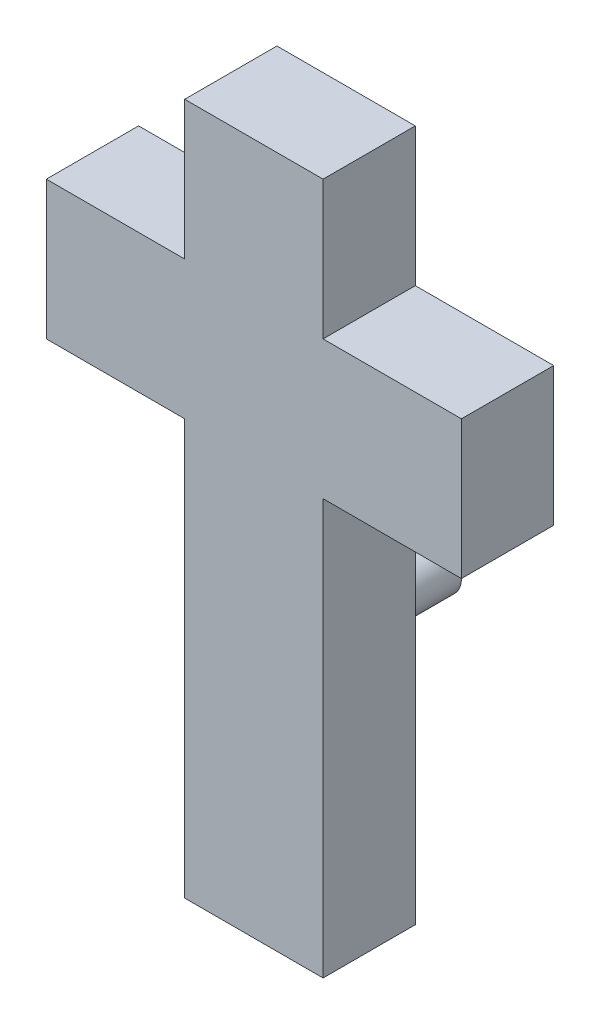
ISO-10303-21;
HEADER;
FILE_DESCRIPTION(('STEP AP214'),'2;1');
FILE_NAME('part.step','',(''),(''),'','','');
FILE_SCHEMA(('AUTOMOTIVE_DESIGN { 1 0 10303 214 1 1 1 1 }'));
ENDSEC;
DATA;
#1=APPLICATION_CONTEXT('core data for automotive mechanical design processes');
#2=APPLICATION_PROTOCOL_DEFINITION('international standard','automotive_design',2000,#1);
#3=PRODUCT_CONTEXT('',#1,'mechanical');
#4=PRODUCT('Part','Part','',(#3));
#5=PRODUCT_RELATED_PRODUCT_CATEGORY('part','',(#4));
#6=PRODUCT_DEFINITION_FORMATION('','',#4);
#7=PRODUCT_DEFINITION_CONTEXT('part definition',#1,'design');
#8=PRODUCT_DEFINITION('design','',#6,#7);
#9=PRODUCT_DEFINITION_SHAPE('','',#8);
#10=(LENGTH_UNIT() NAMED_UNIT(*) SI_UNIT(.MILLI.,.METRE.));
#11=(NAMED_UNIT(*) PLANE_ANGLE_UNIT() SI_UNIT($,.RADIAN.));
#12=(NAMED_UNIT(*) SI_UNIT($,.STERADIAN.) SOLID_ANGLE_UNIT());
#13=UNCERTAINTY_MEASURE_WITH_UNIT(LENGTH_MEASURE(1.E-05),#10,'distance_accuracy_value','');
#14=(GEOMETRIC_REPRESENTATION_CONTEXT(3) GLOBAL_UNCERTAINTY_ASSIGNED_CONTEXT((#13)) GLOBAL_UNIT_ASSIGNED_CONTEXT((#10,
#11,#12)) REPRESENTATION_CONTEXT('',''));
#15=CARTESIAN_POINT('',(0.,0.,0.));
#16=DIRECTION('',(0.,0.,1.));
#17=DIRECTION('',(1.,0.,0.));
#18=AXIS2_PLACEMENT_3D('',#15,#16,#17);
#19=CARTESIAN_POINT('',(-7.62,22.86,5.08));
#20=DIRECTION('',(-1.,0.,0.));
#21=DIRECTION('',(0.,0.,1.));
#22=AXIS2_PLACEMENT_3D('',#19,#20,#21);
#23=PLANE('',#22);
#24=DIRECTION('',(0.,1.,0.));
#25=VECTOR('',#24,1.);
#26=CARTESIAN_POINT('',(-7.62,22.86,0.));
#27=LINE('',#26,#25);
#28=CARTESIAN_POINT('',(-7.62,22.86,0.));
#29=VERTEX_POINT('',#28);
#30=CARTESIAN_POINT('',(-7.62,30.48,0.));
#31=VERTEX_POINT('',#30);
#32=EDGE_CURVE('E156',#29,#31,#27,.T.);
#33=ORIENTED_EDGE('',*,*,#32,.F.);
#34=DIRECTION('',(0.,0.,-1.));
#35=VECTOR('',#34,1.);
#36=CARTESIAN_POINT('',(-7.62,22.86,5.08));
#37=LINE('',#36,#35);
#38=CARTESIAN_POINT('',(-7.62,22.86,5.08));
#39=VERTEX_POINT('',#38);
#40=EDGE_CURVE('E11',#39,#29,#37,.T.);
#41=ORIENTED_EDGE('',*,*,#40,.F.);
#42=DIRECTION('',(0.,1.,0.));
#43=VECTOR('',#42,1.);
#44=CARTESIAN_POINT('',(-7.62,22.86,5.08));
#45=LINE('',#44,#43);
#46=CARTESIAN_POINT('',(-7.62,30.48,5.08));
#47=VERTEX_POINT('',#46);
#48=EDGE_CURVE('E189',#39,#47,#45,.T.);
#49=ORIENTED_EDGE('',*,*,#48,.T.);
#50=DIRECTION('',(0.,0.,-1.));
#51=VECTOR('',#50,1.);
#52=CARTESIAN_POINT('',(-7.62,30.48,5.08));
#53=LINE('',#52,#51);
#54=EDGE_CURVE('E38',#47,#31,#53,.T.);
#55=ORIENTED_EDGE('',*,*,#54,.T.);
#56=EDGE_LOOP('',(#33,#41,#49,#55));
#57=FACE_BOUND('',#56,.T.);
#58=ADVANCED_FACE('F35',(#57),#23,.T.);
#59=CARTESIAN_POINT('',(0.,22.86,5.08));
#60=DIRECTION('',(0.,-1.,0.));
#61=DIRECTION('',(1.,0.,0.));
#62=AXIS2_PLACEMENT_3D('',#59,#60,#61);
#63=PLANE('',#62);
#64=DIRECTION('',(-1.,0.,0.));
#65=VECTOR('',#64,1.);
#66=CARTESIAN_POINT('',(0.,22.86,0.));
#67=LINE('',#66,#65);
#68=CARTESIAN_POINT('',(0.,22.86,0.));
#69=VERTEX_POINT('',#68);
#70=EDGE_CURVE('E187',#69,#29,#67,.T.);
#71=ORIENTED_EDGE('',*,*,#70,.F.);
#72=DIRECTION('',(0.,0.,-1.));
#73=VECTOR('',#72,1.);
#74=CARTESIAN_POINT('',(0.,22.86,5.08));
#75=LINE('',#74,#73);
#76=CARTESIAN_POINT('',(0.,22.86,5.08));
#77=VERTEX_POINT('',#76);
#78=EDGE_CURVE('E44',#77,#69,#75,.T.);
#79=ORIENTED_EDGE('',*,*,#78,.F.);
#80=DIRECTION('',(-1.,0.,0.));
#81=VECTOR('',#80,1.);
#82=CARTESIAN_POINT('',(0.,22.86,5.08));
#83=LINE('',#82,#81);
#84=EDGE_CURVE('E146',#77,#39,#83,.T.);
#85=ORIENTED_EDGE('',*,*,#84,.T.);
#86=ORIENTED_EDGE('',*,*,#40,.T.);
#87=EDGE_LOOP('',(#71,#79,#85,#86));
#88=FACE_BOUND('',#87,.T.);
#89=ADVANCED_FACE('F209',(#88),#63,.T.);
#90=CARTESIAN_POINT('',(0.,0.,5.08));
#91=DIRECTION('',(-1.,0.,0.));
#92=DIRECTION('',(0.,0.,1.));
#93=AXIS2_PLACEMENT_3D('',#90,#91,#92);
#94=PLANE('',#93);
#95=DIRECTION('',(0.,1.,0.));
#96=VECTOR('',#95,1.);
#97=CARTESIAN_POINT('',(0.,0.,0.));
#98=LINE('',#97,#96);
#99=CARTESIAN_POINT('',(0.,0.,0.));
#100=VERTEX_POINT('',#99);
#101=EDGE_CURVE('E133',#100,#69,#98,.T.);
#102=ORIENTED_EDGE('',*,*,#101,.F.);
#103=DIRECTION('',(0.,0.,-1.));
#104=VECTOR('',#103,1.);
#105=CARTESIAN_POINT('',(0.,0.,5.08));
#106=LINE('',#105,#104);
#107=CARTESIAN_POINT('',(0.,0.,5.08));
#108=VERTEX_POINT('',#107);
#109=EDGE_CURVE('E128',#108,#100,#106,.T.);
#110=ORIENTED_EDGE('',*,*,#109,.F.);
#111=DIRECTION('',(0.,1.,0.));
#112=VECTOR('',#111,1.);
#113=CARTESIAN_POINT('',(0.,0.,5.08));
#114=LINE('',#113,#112);
#115=EDGE_CURVE('E131',#108,#77,#114,.T.);
#116=ORIENTED_EDGE('',*,*,#115,.T.);
#117=ORIENTED_EDGE('',*,*,#78,.T.);
#118=EDGE_LOOP('',(#102,#110,#116,#117));
#119=FACE_BOUND('',#118,.T.);
#120=ADVANCED_FACE('F130',(#119),#94,.T.);
#121=CARTESIAN_POINT('',(7.62,0.,5.08));
#122=DIRECTION('',(0.,-1.,0.));
#123=DIRECTION('',(1.,0.,0.));
#124=AXIS2_PLACEMENT_3D('',#121,#122,#123);
#125=PLANE('',#124);
#126=DIRECTION('',(-1.,0.,0.));
#127=VECTOR('',#126,1.);
#128=CARTESIAN_POINT('',(7.62,0.,0.));
#129=LINE('',#128,#127);
#130=CARTESIAN_POINT('',(7.62,0.,0.));
#131=VERTEX_POINT('',#130);
#132=EDGE_CURVE('E184',#131,#100,#129,.T.);
#133=ORIENTED_EDGE('',*,*,#132,.F.);
#134=DIRECTION('',(0.,0.,-1.));
#135=VECTOR('',#134,1.);
#136=CARTESIAN_POINT('',(7.62,0.,5.08));
#137=LINE('',#136,#135);
#138=CARTESIAN_POINT('',(7.62,0.,5.08));
#139=VERTEX_POINT('',#138);
#140=EDGE_CURVE('E138',#139,#131,#137,.T.);
#141=ORIENTED_EDGE('',*,*,#140,.F.);
#142=DIRECTION('',(-1.,0.,0.));
#143=VECTOR('',#142,1.);
#144=CARTESIAN_POINT('',(7.62,0.,5.08));
#145=LINE('',#144,#143);
#146=EDGE_CURVE('E144',#139,#108,#145,.T.);
#147=ORIENTED_EDGE('',*,*,#146,.T.);
#148=ORIENTED_EDGE('',*,*,#109,.T.);
#149=EDGE_LOOP('',(#133,#141,#147,#148));
#150=FACE_BOUND('',#149,.T.);
#151=ADVANCED_FACE('F148',(#150),#125,.T.);
#152=CARTESIAN_POINT('',(7.62,22.86,5.08));
#153=DIRECTION('',(1.,0.,0.));
#154=DIRECTION('',(0.,1.,0.));
#155=AXIS2_PLACEMENT_3D('',#152,#153,#154);
#156=PLANE('',#155);
#157=DIRECTION('',(0.,-1.,0.));
#158=VECTOR('',#157,1.);
#159=CARTESIAN_POINT('',(7.62,22.86,0.));
#160=LINE('',#159,#158);
#161=CARTESIAN_POINT('',(7.62,22.86,0.));
#162=VERTEX_POINT('',#161);
#163=EDGE_CURVE('E181',#162,#131,#160,.T.);
#164=ORIENTED_EDGE('',*,*,#163,.F.);
#165=DIRECTION('',(0.,0.,-1.));
#166=VECTOR('',#165,1.);
#167=CARTESIAN_POINT('',(7.62,22.86,5.08));
#168=LINE('',#167,#166);
#169=CARTESIAN_POINT('',(7.62,22.86,5.08));
#170=VERTEX_POINT('',#169);
#171=EDGE_CURVE('E193',#170,#162,#168,.T.);
#172=ORIENTED_EDGE('',*,*,#171,.F.);
#173=DIRECTION('',(0.,-1.,0.));
#174=VECTOR('',#173,1.);
#175=CARTESIAN_POINT('',(7.62,22.86,5.08));
#176=LINE('',#175,#174);
#177=EDGE_CURVE('E149',#170,#139,#176,.T.);
#178=ORIENTED_EDGE('',*,*,#177,.T.);
#179=ORIENTED_EDGE('',*,*,#140,.T.);
#180=EDGE_LOOP('',(#164,#172,#178,#179));
#181=FACE_BOUND('',#180,.T.);
#182=ADVANCED_FACE('F222',(#181),#156,.T.);
#183=CARTESIAN_POINT('',(15.24,22.86,5.08));
#184=DIRECTION('',(0.,-1.,0.));
#185=DIRECTION('',(1.,0.,0.));
#186=AXIS2_PLACEMENT_3D('',#183,#184,#185);
#187=PLANE('',#186);
#188=DIRECTION('',(-1.,0.,0.));
#189=VECTOR('',#188,1.);
#190=CARTESIAN_POINT('',(15.24,22.86,0.));
#191=LINE('',#190,#189);
#192=CARTESIAN_POINT('',(15.24,22.86,0.));
#193=VERTEX_POINT('',#192);
#194=EDGE_CURVE('E178',#193,#162,#191,.T.);
#195=ORIENTED_EDGE('',*,*,#194,.F.);
#196=DIRECTION('',(0.,0.,-1.));
#197=VECTOR('',#196,1.);
#198=CARTESIAN_POINT('',(15.24,22.86,5.08));
#199=LINE('',#198,#197);
#200=CARTESIAN_POINT('',(15.24,22.86,5.08));
#201=VERTEX_POINT('',#200);
#202=EDGE_CURVE('E195',#201,#193,#199,.T.);
#203=ORIENTED_EDGE('',*,*,#202,.F.);
#204=DIRECTION('',(-1.,0.,0.));
#205=VECTOR('',#204,1.);
#206=CARTESIAN_POINT('',(15.24,22.86,5.08));
#207=LINE('',#206,#205);
#208=EDGE_CURVE('E151',#201,#170,#207,.T.);
#209=ORIENTED_EDGE('',*,*,#208,.T.);
#210=ORIENTED_EDGE('',*,*,#171,.T.);
#211=EDGE_LOOP('',(#195,#203,#209,#210));
#212=FACE_BOUND('',#211,.T.);
#213=ADVANCED_FACE('F225',(#212),#187,.T.);
#214=CARTESIAN_POINT('',(15.24,30.48,5.08));
#215=DIRECTION('',(1.,0.,0.));
#216=DIRECTION('',(0.,0.,-1.));
#217=AXIS2_PLACEMENT_3D('',#214,#215,#216);
#218=PLANE('',#217);
#219=DIRECTION('',(0.,-1.,0.));
#220=VECTOR('',#219,1.);
#221=CARTESIAN_POINT('',(15.24,30.48,0.));
#222=LINE('',#221,#220);
#223=CARTESIAN_POINT('',(15.24,30.48,0.));
#224=VERTEX_POINT('',#223);
#225=EDGE_CURVE('E175',#224,#193,#222,.T.);
#226=ORIENTED_EDGE('',*,*,#225,.F.);
#227=DIRECTION('',(0.,0.,-1.));
#228=VECTOR('',#227,1.);
#229=CARTESIAN_POINT('',(15.24,30.48,5.08));
#230=LINE('',#229,#228);
#231=CARTESIAN_POINT('',(15.24,30.48,5.08));
#232=VERTEX_POINT('',#231);
#233=EDGE_CURVE('E197',#232,#224,#230,.T.);
#234=ORIENTED_EDGE('',*,*,#233,.F.);
#235=DIRECTION('',(0.,-1.,0.));
#236=VECTOR('',#235,1.);
#237=CARTESIAN_POINT('',(15.24,30.48,5.08));
#238=LINE('',#237,#236);
#239=EDGE_CURVE('E303',#232,#201,#238,.T.);
#240=ORIENTED_EDGE('',*,*,#239,.T.);
#241=ORIENTED_EDGE('',*,*,#202,.T.);
#242=EDGE_LOOP('',(#226,#234,#240,#241));
#243=FACE_BOUND('',#242,.T.);
#244=ADVANCED_FACE('F229',(#243),#218,.T.);
#245=CARTESIAN_POINT('',(7.62,30.48,5.08));
#246=DIRECTION('',(0.,1.,0.));
#247=DIRECTION('',(0.,0.,1.));
#248=AXIS2_PLACEMENT_3D('',#245,#246,#247);
#249=PLANE('',#248);
#250=DIRECTION('',(1.,0.,0.));
#251=VECTOR('',#250,1.);
#252=CARTESIAN_POINT('',(7.62,30.48,0.));
#253=LINE('',#252,#251);
#254=CARTESIAN_POINT('',(7.62,30.48,0.));
#255=VERTEX_POINT('',#254);
#256=EDGE_CURVE('E172',#255,#224,#253,.T.);
#257=ORIENTED_EDGE('',*,*,#256,.F.);
#258=DIRECTION('',(0.,0.,-1.));
#259=VECTOR('',#258,1.);
#260=CARTESIAN_POINT('',(7.62,30.48,5.08));
#261=LINE('',#260,#259);
#262=CARTESIAN_POINT('',(7.62,30.48,5.08));
#263=VERTEX_POINT('',#262);
#264=EDGE_CURVE('E199',#263,#255,#261,.T.);
#265=ORIENTED_EDGE('',*,*,#264,.F.);
#266=DIRECTION('',(1.,0.,0.));
#267=VECTOR('',#266,1.);
#268=CARTESIAN_POINT('',(7.62,30.48,5.08));
#269=LINE('',#268,#267);
#270=EDGE_CURVE('E300',#263,#232,#269,.T.);
#271=ORIENTED_EDGE('',*,*,#270,.T.);
#272=ORIENTED_EDGE('',*,*,#233,.T.);
#273=EDGE_LOOP('',(#257,#265,#271,#272));
#274=FACE_BOUND('',#273,.T.);
#275=ADVANCED_FACE('F233',(#274),#249,.T.);
#276=CARTESIAN_POINT('',(7.62,38.1,5.08));
#277=DIRECTION('',(1.,0.,0.));
#278=DIRECTION('',(0.,1.,0.));
#279=AXIS2_PLACEMENT_3D('',#276,#277,#278);
#280=PLANE('',#279);
#281=DIRECTION('',(0.,-1.,0.));
#282=VECTOR('',#281,1.);
#283=CARTESIAN_POINT('',(7.62,38.1,0.));
#284=LINE('',#283,#282);
#285=CARTESIAN_POINT('',(7.62,38.1,0.));
#286=VERTEX_POINT('',#285);
#287=EDGE_CURVE('E169',#286,#255,#284,.T.);
#288=ORIENTED_EDGE('',*,*,#287,.F.);
#289=DIRECTION('',(0.,0.,-1.));
#290=VECTOR('',#289,1.);
#291=CARTESIAN_POINT('',(7.62,38.1,5.08));
#292=LINE('',#291,#290);
#293=CARTESIAN_POINT('',(7.62,38.1,5.08));
#294=VERTEX_POINT('',#293);
#295=EDGE_CURVE('E201',#294,#286,#292,.T.);
#296=ORIENTED_EDGE('',*,*,#295,.F.);
#297=DIRECTION('',(0.,-1.,0.));
#298=VECTOR('',#297,1.);
#299=CARTESIAN_POINT('',(7.62,38.1,5.08));
#300=LINE('',#299,#298);
#301=EDGE_CURVE('E297',#294,#263,#300,.T.);
#302=ORIENTED_EDGE('',*,*,#301,.T.);
#303=ORIENTED_EDGE('',*,*,#264,.T.);
#304=EDGE_LOOP('',(#288,#296,#302,#303));
#305=FACE_BOUND('',#304,.T.);
#306=ADVANCED_FACE('F237',(#305),#280,.T.);
#307=CARTESIAN_POINT('',(0.,38.1,5.08));
#308=DIRECTION('',(0.,1.,0.));
#309=DIRECTION('',(0.,0.,1.));
#310=AXIS2_PLACEMENT_3D('',#307,#308,#309);
#311=PLANE('',#310);
#312=DIRECTION('',(1.,0.,0.));
#313=VECTOR('',#312,1.);
#314=CARTESIAN_POINT('',(0.,38.1,0.));
#315=LINE('',#314,#313);
#316=CARTESIAN_POINT('',(0.,38.1,0.));
#317=VERTEX_POINT('',#316);
#318=EDGE_CURVE('E166',#317,#286,#315,.T.);
#319=ORIENTED_EDGE('',*,*,#318,.F.);
#320=DIRECTION('',(0.,0.,-1.));
#321=VECTOR('',#320,1.);
#322=CARTESIAN_POINT('',(0.,38.1,5.08));
#323=LINE('',#322,#321);
#324=CARTESIAN_POINT('',(0.,38.1,5.08));
#325=VERTEX_POINT('',#324);
#326=EDGE_CURVE('E203',#325,#317,#323,.T.);
#327=ORIENTED_EDGE('',*,*,#326,.F.);
#328=DIRECTION('',(1.,0.,0.));
#329=VECTOR('',#328,1.);
#330=CARTESIAN_POINT('',(0.,38.1,5.08));
#331=LINE('',#330,#329);
#332=EDGE_CURVE('E294',#325,#294,#331,.T.);
#333=ORIENTED_EDGE('',*,*,#332,.T.);
#334=ORIENTED_EDGE('',*,*,#295,.T.);
#335=EDGE_LOOP('',(#319,#327,#333,#334));
#336=FACE_BOUND('',#335,.T.);
#337=ADVANCED_FACE('F241',(#336),#311,.T.);
#338=CARTESIAN_POINT('',(0.,30.48,5.08));
#339=DIRECTION('',(-1.,0.,0.));
#340=DIRECTION('',(0.,0.,1.));
#341=AXIS2_PLACEMENT_3D('',#338,#339,#340);
#342=PLANE('',#341);
#343=DIRECTION('',(0.,1.,0.));
#344=VECTOR('',#343,1.);
#345=CARTESIAN_POINT('',(0.,30.48,0.));
#346=LINE('',#345,#344);
#347=CARTESIAN_POINT('',(0.,30.48,0.));
#348=VERTEX_POINT('',#347);
#349=EDGE_CURVE('E163',#348,#317,#346,.T.);
#350=ORIENTED_EDGE('',*,*,#349,.F.);
#351=DIRECTION('',(0.,0.,-1.));
#352=VECTOR('',#351,1.);
#353=CARTESIAN_POINT('',(0.,30.48,5.08));
#354=LINE('',#353,#352);
#355=CARTESIAN_POINT('',(0.,30.48,5.08));
#356=VERTEX_POINT('',#355);
#357=EDGE_CURVE('E204',#356,#348,#354,.T.);
#358=ORIENTED_EDGE('',*,*,#357,.F.);
#359=DIRECTION('',(0.,1.,0.));
#360=VECTOR('',#359,1.);
#361=CARTESIAN_POINT('',(0.,30.48,5.08));
#362=LINE('',#361,#360);
#363=EDGE_CURVE('E291',#356,#325,#362,.T.);
#364=ORIENTED_EDGE('',*,*,#363,.T.);
#365=ORIENTED_EDGE('',*,*,#326,.T.);
#366=EDGE_LOOP('',(#350,#358,#364,#365));
#367=FACE_BOUND('',#366,.T.);
#368=ADVANCED_FACE('F245',(#367),#342,.T.);
#369=CARTESIAN_POINT('',(-7.62,30.48,5.08));
#370=DIRECTION('',(0.,1.,0.));
#371=DIRECTION('',(0.,0.,1.));
#372=AXIS2_PLACEMENT_3D('',#369,#370,#371);
#373=PLANE('',#372);
#374=DIRECTION('',(1.,0.,0.));
#375=VECTOR('',#374,1.);
#376=CARTESIAN_POINT('',(-7.62,30.48,0.));
#377=LINE('',#376,#375);
#378=EDGE_CURVE('E159',#31,#348,#377,.T.);
#379=ORIENTED_EDGE('',*,*,#378,.F.);
#380=ORIENTED_EDGE('',*,*,#54,.F.);
#381=DIRECTION('',(1.,0.,0.));
#382=VECTOR('',#381,1.);
#383=CARTESIAN_POINT('',(-7.62,30.48,5.08));
#384=LINE('',#383,#382);
#385=EDGE_CURVE('E289',#47,#356,#384,.T.);
#386=ORIENTED_EDGE('',*,*,#385,.T.);
#387=ORIENTED_EDGE('',*,*,#357,.T.);
#388=EDGE_LOOP('',(#379,#380,#386,#387));
#389=FACE_BOUND('',#388,.T.);
#390=ADVANCED_FACE('F206',(#389),#373,.T.);
#391=CARTESIAN_POINT('',(0.,0.,5.08));
#392=DIRECTION('',(0.,0.,-1.));
#393=DIRECTION('',(-1.,0.,0.));
#394=AXIS2_PLACEMENT_3D('',#391,#392,#393);
#395=PLANE('',#394);
#396=ORIENTED_EDGE('',*,*,#48,.F.);
#397=ORIENTED_EDGE('',*,*,#84,.F.);
#398=ORIENTED_EDGE('',*,*,#115,.F.);
#399=ORIENTED_EDGE('',*,*,#146,.F.);
#400=ORIENTED_EDGE('',*,*,#177,.F.);
#401=ORIENTED_EDGE('',*,*,#208,.F.);
#402=ORIENTED_EDGE('',*,*,#239,.F.);
#403=ORIENTED_EDGE('',*,*,#270,.F.);
#404=ORIENTED_EDGE('',*,*,#301,.F.);
#405=ORIENTED_EDGE('',*,*,#332,.F.);
#406=ORIENTED_EDGE('',*,*,#363,.F.);
#407=ORIENTED_EDGE('',*,*,#385,.F.);
#408=EDGE_LOOP('',(#396,#397,#398,#399,#400,#401,#402,#403,#404,#405,#406,#407));
#409=FACE_BOUND('',#408,.T.);
#410=ADVANCED_FACE('F142',(#409),#395,.F.);
#411=CARTESIAN_POINT('',(0.,0.,0.));
#412=DIRECTION('',(0.,0.,-1.));
#413=DIRECTION('',(-1.,0.,0.));
#414=AXIS2_PLACEMENT_3D('',#411,#412,#413);
#415=PLANE('',#414);
#416=CARTESIAN_POINT('',(3.81,12.7,0.));
#417=DIRECTION('',(0.,0.,-1.));
#418=DIRECTION('',(-1.,0.,0.));
#419=AXIS2_PLACEMENT_3D('',#416,#417,#418);
#420=CIRCLE('',#419,1.27);
#421=CARTESIAN_POINT('',(2.54,12.7,0.));
#422=VERTEX_POINT('',#421);
#423=EDGE_CURVE('E279',#422,#422,#420,.T.);
#424=ORIENTED_EDGE('',*,*,#423,.F.);
#425=EDGE_LOOP('',(#424));
#426=FACE_BOUND('',#425,.T.);
#427=CARTESIAN_POINT('',(3.81,20.32,0.));
#428=DIRECTION('',(0.,0.,-1.));
#429=DIRECTION('',(-1.,0.,0.));
#430=AXIS2_PLACEMENT_3D('',#427,#428,#429);
#431=CIRCLE('',#430,1.27);
#432=CARTESIAN_POINT('',(2.54,20.32,0.));
#433=VERTEX_POINT('',#432);
#434=EDGE_CURVE('E278',#433,#433,#431,.T.);
#435=ORIENTED_EDGE('',*,*,#434,.F.);
#436=EDGE_LOOP('',(#435));
#437=FACE_BOUND('',#436,.T.);
#438=ORIENTED_EDGE('',*,*,#32,.T.);
#439=ORIENTED_EDGE('',*,*,#378,.T.);
#440=ORIENTED_EDGE('',*,*,#349,.T.);
#441=ORIENTED_EDGE('',*,*,#318,.T.);
#442=ORIENTED_EDGE('',*,*,#287,.T.);
#443=ORIENTED_EDGE('',*,*,#256,.T.);
#444=ORIENTED_EDGE('',*,*,#225,.T.);
#445=ORIENTED_EDGE('',*,*,#194,.T.);
#446=ORIENTED_EDGE('',*,*,#163,.T.);
#447=ORIENTED_EDGE('',*,*,#132,.T.);
#448=ORIENTED_EDGE('',*,*,#101,.T.);
#449=ORIENTED_EDGE('',*,*,#70,.T.);
#450=EDGE_LOOP('',(#438,#439,#440,#441,#442,#443,#444,#445,#446,#447,#448,#449));
#451=FACE_BOUND('',#450,.T.);
#452=ADVANCED_FACE('F208',(#426,#437,#451),#415,.T.);
#453=CARTESIAN_POINT('',(3.81,20.32,-5.08));
#454=DIRECTION('',(0.,0.,1.));
#455=DIRECTION('',(1.,0.,0.));
#456=AXIS2_PLACEMENT_3D('',#453,#454,#455);
#457=CYLINDRICAL_SURFACE('',#456,1.27);
#458=CARTESIAN_POINT('',(3.81,20.32,-5.08));
#459=DIRECTION('',(0.,0.,-1.));
#460=DIRECTION('',(-1.,0.,0.));
#461=AXIS2_PLACEMENT_3D('',#458,#459,#460);
#462=CIRCLE('',#461,1.27);
#463=CARTESIAN_POINT('',(2.54,20.32,-5.08));
#464=VERTEX_POINT('',#463);
#465=EDGE_CURVE('E160',#464,#464,#462,.T.);
#466=ORIENTED_EDGE('',*,*,#465,.F.);
#467=EDGE_LOOP('',(#466));
#468=FACE_BOUND('',#467,.T.);
#469=ORIENTED_EDGE('',*,*,#434,.T.);
#470=EDGE_LOOP('',(#469));
#471=FACE_BOUND('',#470,.T.);
#472=ADVANCED_FACE('F256',(#468,#471),#457,.T.);
#473=CARTESIAN_POINT('',(3.81,20.32,-5.08));
#474=DIRECTION('',(0.,0.,-1.));
#475=DIRECTION('',(-1.,0.,0.));
#476=AXIS2_PLACEMENT_3D('',#473,#474,#475);
#477=PLANE('',#476);
#478=ORIENTED_EDGE('',*,*,#465,.T.);
#479=EDGE_LOOP('',(#478));
#480=FACE_BOUND('',#479,.T.);
#481=ADVANCED_FACE('F261',(#480),#477,.T.);
#482=CARTESIAN_POINT('',(3.81,12.7,-5.08));
#483=DIRECTION('',(0.,0.,1.));
#484=DIRECTION('',(1.,0.,0.));
#485=AXIS2_PLACEMENT_3D('',#482,#483,#484);
#486=CYLINDRICAL_SURFACE('',#485,1.27);
#487=CARTESIAN_POINT('',(3.81,12.7,-5.08));
#488=DIRECTION('',(0.,0.,-1.));
#489=DIRECTION('',(-1.,0.,0.));
#490=AXIS2_PLACEMENT_3D('',#487,#488,#489);
#491=CIRCLE('',#490,1.27);
#492=CARTESIAN_POINT('',(2.54,12.7,-5.08));
#493=VERTEX_POINT('',#492);
#494=EDGE_CURVE('E277',#493,#493,#491,.T.);
#495=ORIENTED_EDGE('',*,*,#494,.F.);
#496=EDGE_LOOP('',(#495));
#497=FACE_BOUND('',#496,.T.);
#498=ORIENTED_EDGE('',*,*,#423,.T.);
#499=EDGE_LOOP('',(#498));
#500=FACE_BOUND('',#499,.T.);
#501=ADVANCED_FACE('F265',(#497,#500),#486,.T.);
#502=CARTESIAN_POINT('',(3.81,12.7,-5.08));
#503=DIRECTION('',(0.,0.,-1.));
#504=DIRECTION('',(-1.,0.,0.));
#505=AXIS2_PLACEMENT_3D('',#502,#503,#504);
#506=PLANE('',#505);
#507=ORIENTED_EDGE('',*,*,#494,.T.);
#508=EDGE_LOOP('',(#507));
#509=FACE_BOUND('',#508,.T.);
#510=ADVANCED_FACE('F269',(#509),#506,.T.);
#511=CLOSED_SHELL('',(#58,#89,#120,#151,#182,#213,#244,#275,#306,#337,#368,#390,#410,#452,#472,
#481,#501,#510));
#512=MANIFOLD_SOLID_BREP('B2',#511);
#513=ADVANCED_BREP_SHAPE_REPRESENTATION('',(#18,#512),#14);
#514=SHAPE_DEFINITION_REPRESENTATION(#9,#513);
ENDSEC;
END-ISO-10303-21;
